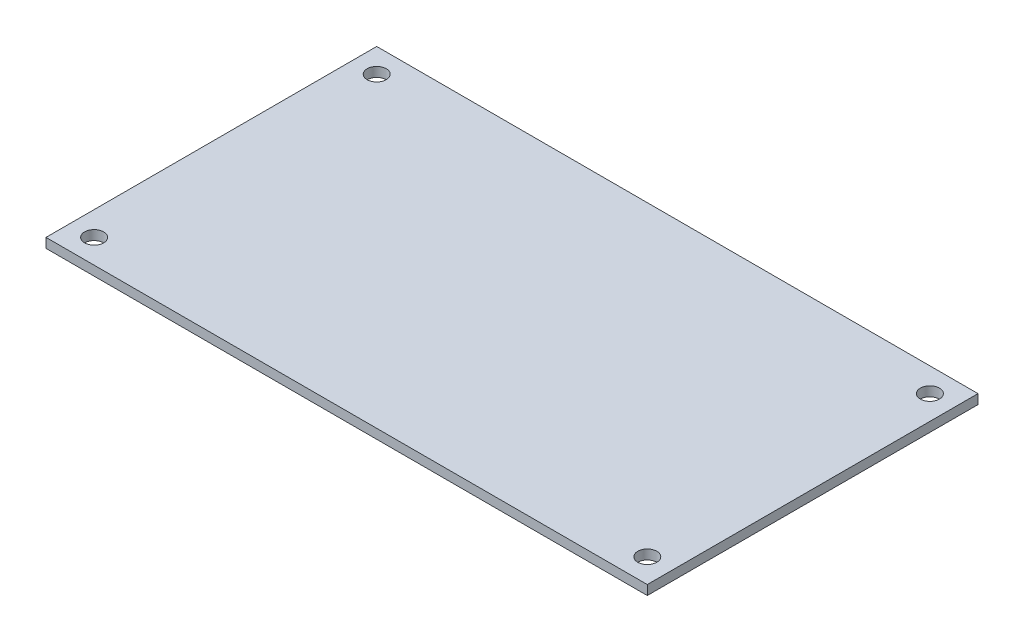
ISO-10303-21;
HEADER;
FILE_DESCRIPTION(('STEP AP214'),'2;1');
FILE_NAME('part.step','',(''),(''),'','','');
FILE_SCHEMA(('AUTOMOTIVE_DESIGN { 1 0 10303 214 1 1 1 1 }'));
ENDSEC;
DATA;
#1=APPLICATION_CONTEXT('core data for automotive mechanical design processes');
#2=APPLICATION_PROTOCOL_DEFINITION('international standard','automotive_design',2000,#1);
#3=PRODUCT_CONTEXT('',#1,'mechanical');
#4=PRODUCT('Part','Part','',(#3));
#5=PRODUCT_RELATED_PRODUCT_CATEGORY('part','',(#4));
#6=PRODUCT_DEFINITION_FORMATION('','',#4);
#7=PRODUCT_DEFINITION_CONTEXT('part definition',#1,'design');
#8=PRODUCT_DEFINITION('design','',#6,#7);
#9=PRODUCT_DEFINITION_SHAPE('','',#8);
#10=(LENGTH_UNIT() NAMED_UNIT(*) SI_UNIT(.MILLI.,.METRE.));
#11=(NAMED_UNIT(*) PLANE_ANGLE_UNIT() SI_UNIT($,.RADIAN.));
#12=(NAMED_UNIT(*) SI_UNIT($,.STERADIAN.) SOLID_ANGLE_UNIT());
#13=UNCERTAINTY_MEASURE_WITH_UNIT(LENGTH_MEASURE(1.E-05),#10,'distance_accuracy_value','');
#14=(GEOMETRIC_REPRESENTATION_CONTEXT(3) GLOBAL_UNCERTAINTY_ASSIGNED_CONTEXT((#13)) GLOBAL_UNIT_ASSIGNED_CONTEXT((#10,
#11,#12)) REPRESENTATION_CONTEXT('',''));
#15=CARTESIAN_POINT('',(0.,0.,0.));
#16=DIRECTION('',(0.,0.,1.));
#17=DIRECTION('',(1.,0.,0.));
#18=AXIS2_PLACEMENT_3D('',#15,#16,#17);
#19=CARTESIAN_POINT('',(0.,3.175,0.));
#20=DIRECTION('',(1.,0.,0.));
#21=DIRECTION('',(0.,0.,-1.));
#22=AXIS2_PLACEMENT_3D('',#19,#20,#21);
#23=PLANE('',#22);
#24=DIRECTION('',(0.,0.,1.));
#25=VECTOR('',#24,1.);
#26=CARTESIAN_POINT('',(0.,0.,0.));
#27=LINE('',#26,#25);
#28=CARTESIAN_POINT('',(0.,0.,-110.));
#29=VERTEX_POINT('',#28);
#30=CARTESIAN_POINT('',(0.,0.,0.));
#31=VERTEX_POINT('',#30);
#32=EDGE_CURVE('E96',#29,#31,#27,.T.);
#33=ORIENTED_EDGE('',*,*,#32,.T.);
#34=DIRECTION('',(0.,-1.,0.));
#35=VECTOR('',#34,1.);
#36=CARTESIAN_POINT('',(0.,3.175,0.));
#37=LINE('',#36,#35);
#38=CARTESIAN_POINT('',(0.,3.175,0.));
#39=VERTEX_POINT('',#38);
#40=EDGE_CURVE('E11',#39,#31,#37,.T.);
#41=ORIENTED_EDGE('',*,*,#40,.F.);
#42=DIRECTION('',(0.,0.,1.));
#43=VECTOR('',#42,1.);
#44=CARTESIAN_POINT('',(0.,3.175,0.));
#45=LINE('',#44,#43);
#46=CARTESIAN_POINT('',(0.,3.175,-110.));
#47=VERTEX_POINT('',#46);
#48=EDGE_CURVE('E84',#47,#39,#45,.T.);
#49=ORIENTED_EDGE('',*,*,#48,.F.);
#50=DIRECTION('',(0.,-1.,0.));
#51=VECTOR('',#50,1.);
#52=CARTESIAN_POINT('',(0.,3.175,-110.));
#53=LINE('',#52,#51);
#54=EDGE_CURVE('E92',#47,#29,#53,.T.);
#55=ORIENTED_EDGE('',*,*,#54,.T.);
#56=EDGE_LOOP('',(#33,#41,#49,#55));
#57=FACE_BOUND('',#56,.T.);
#58=ADVANCED_FACE('F33',(#57),#23,.F.);
#59=CARTESIAN_POINT('',(0.,3.175,0.));
#60=DIRECTION('',(0.,0.,-1.));
#61=DIRECTION('',(-1.,0.,0.));
#62=AXIS2_PLACEMENT_3D('',#59,#60,#61);
#63=PLANE('',#62);
#64=DIRECTION('',(1.,0.,0.));
#65=VECTOR('',#64,1.);
#66=CARTESIAN_POINT('',(0.,0.,0.));
#67=LINE('',#66,#65);
#68=CARTESIAN_POINT('',(200.,0.,0.));
#69=VERTEX_POINT('',#68);
#70=EDGE_CURVE('E88',#31,#69,#67,.T.);
#71=ORIENTED_EDGE('',*,*,#70,.T.);
#72=DIRECTION('',(0.,-1.,0.));
#73=VECTOR('',#72,1.);
#74=CARTESIAN_POINT('',(200.,3.175,0.));
#75=LINE('',#74,#73);
#76=CARTESIAN_POINT('',(200.,3.175,0.));
#77=VERTEX_POINT('',#76);
#78=EDGE_CURVE('E41',#77,#69,#75,.T.);
#79=ORIENTED_EDGE('',*,*,#78,.F.);
#80=DIRECTION('',(1.,0.,0.));
#81=VECTOR('',#80,1.);
#82=CARTESIAN_POINT('',(0.,3.175,0.));
#83=LINE('',#82,#81);
#84=EDGE_CURVE('E79',#39,#77,#83,.T.);
#85=ORIENTED_EDGE('',*,*,#84,.F.);
#86=ORIENTED_EDGE('',*,*,#40,.T.);
#87=EDGE_LOOP('',(#71,#79,#85,#86));
#88=FACE_BOUND('',#87,.T.);
#89=ADVANCED_FACE('F87',(#88),#63,.F.);
#90=CARTESIAN_POINT('',(200.,3.175,0.));
#91=DIRECTION('',(-1.,0.,0.));
#92=DIRECTION('',(0.,0.,1.));
#93=AXIS2_PLACEMENT_3D('',#90,#91,#92);
#94=PLANE('',#93);
#95=DIRECTION('',(0.,0.,-1.));
#96=VECTOR('',#95,1.);
#97=CARTESIAN_POINT('',(200.,0.,0.));
#98=LINE('',#97,#96);
#99=CARTESIAN_POINT('',(200.,0.,-110.));
#100=VERTEX_POINT('',#99);
#101=EDGE_CURVE('E66',#69,#100,#98,.T.);
#102=ORIENTED_EDGE('',*,*,#101,.T.);
#103=DIRECTION('',(0.,-1.,0.));
#104=VECTOR('',#103,1.);
#105=CARTESIAN_POINT('',(200.,3.175,-110.));
#106=LINE('',#105,#104);
#107=CARTESIAN_POINT('',(200.,3.175,-110.));
#108=VERTEX_POINT('',#107);
#109=EDGE_CURVE('E89',#108,#100,#106,.T.);
#110=ORIENTED_EDGE('',*,*,#109,.F.);
#111=DIRECTION('',(0.,0.,-1.));
#112=VECTOR('',#111,1.);
#113=CARTESIAN_POINT('',(200.,3.175,0.));
#114=LINE('',#113,#112);
#115=EDGE_CURVE('E82',#77,#108,#114,.T.);
#116=ORIENTED_EDGE('',*,*,#115,.F.);
#117=ORIENTED_EDGE('',*,*,#78,.T.);
#118=EDGE_LOOP('',(#102,#110,#116,#117));
#119=FACE_BOUND('',#118,.T.);
#120=ADVANCED_FACE('F90',(#119),#94,.F.);
#121=CARTESIAN_POINT('',(0.,3.175,-110.));
#122=DIRECTION('',(0.,0.,1.));
#123=DIRECTION('',(1.,0.,0.));
#124=AXIS2_PLACEMENT_3D('',#121,#122,#123);
#125=PLANE('',#124);
#126=DIRECTION('',(-1.,0.,0.));
#127=VECTOR('',#126,1.);
#128=CARTESIAN_POINT('',(0.,0.,-110.));
#129=LINE('',#128,#127);
#130=EDGE_CURVE('E72',#100,#29,#129,.T.);
#131=ORIENTED_EDGE('',*,*,#130,.T.);
#132=ORIENTED_EDGE('',*,*,#54,.F.);
#133=DIRECTION('',(-1.,0.,0.));
#134=VECTOR('',#133,1.);
#135=CARTESIAN_POINT('',(0.,3.175,-110.));
#136=LINE('',#135,#134);
#137=EDGE_CURVE('E49',#108,#47,#136,.T.);
#138=ORIENTED_EDGE('',*,*,#137,.F.);
#139=ORIENTED_EDGE('',*,*,#109,.T.);
#140=EDGE_LOOP('',(#131,#132,#138,#139));
#141=FACE_BOUND('',#140,.T.);
#142=ADVANCED_FACE('F104',(#141),#125,.F.);
#143=CARTESIAN_POINT('',(0.,3.175,0.));
#144=DIRECTION('',(0.,-1.,0.));
#145=DIRECTION('',(0.,0.,-1.));
#146=AXIS2_PLACEMENT_3D('',#143,#144,#145);
#147=PLANE('',#146);
#148=CARTESIAN_POINT('',(8.,3.175,-7.99999999999999));
#149=DIRECTION('',(0.,1.,0.));
#150=DIRECTION('',(0.,0.,-1.));
#151=AXIS2_PLACEMENT_3D('',#148,#149,#150);
#152=CIRCLE('',#151,3.175);
#153=CARTESIAN_POINT('',(8.,3.175,-11.175));
#154=VERTEX_POINT('',#153);
#155=EDGE_CURVE('E119',#154,#154,#152,.T.);
#156=ORIENTED_EDGE('',*,*,#155,.F.);
#157=EDGE_LOOP('',(#156));
#158=FACE_BOUND('',#157,.T.);
#159=CARTESIAN_POINT('',(192.,3.175,-7.99999999999999));
#160=DIRECTION('',(0.,1.,0.));
#161=DIRECTION('',(0.,0.,1.));
#162=AXIS2_PLACEMENT_3D('',#159,#160,#161);
#163=CIRCLE('',#162,3.175);
#164=CARTESIAN_POINT('',(192.,3.175,-4.825));
#165=VERTEX_POINT('',#164);
#166=EDGE_CURVE('E125',#165,#165,#163,.T.);
#167=ORIENTED_EDGE('',*,*,#166,.F.);
#168=EDGE_LOOP('',(#167));
#169=FACE_BOUND('',#168,.T.);
#170=CARTESIAN_POINT('',(192.,3.175,-102.));
#171=DIRECTION('',(0.,1.,0.));
#172=DIRECTION('',(0.,0.,-1.));
#173=AXIS2_PLACEMENT_3D('',#170,#171,#172);
#174=CIRCLE('',#173,3.175);
#175=CARTESIAN_POINT('',(192.,3.175,-105.175));
#176=VERTEX_POINT('',#175);
#177=EDGE_CURVE('E113',#176,#176,#174,.T.);
#178=ORIENTED_EDGE('',*,*,#177,.F.);
#179=EDGE_LOOP('',(#178));
#180=FACE_BOUND('',#179,.T.);
#181=CARTESIAN_POINT('',(8.,3.175,-102.));
#182=DIRECTION('',(0.,1.,0.));
#183=DIRECTION('',(0.,0.,1.));
#184=AXIS2_PLACEMENT_3D('',#181,#182,#183);
#185=CIRCLE('',#184,3.175);
#186=CARTESIAN_POINT('',(8.,3.175,-98.825));
#187=VERTEX_POINT('',#186);
#188=EDGE_CURVE('E99',#187,#187,#185,.T.);
#189=ORIENTED_EDGE('',*,*,#188,.F.);
#190=EDGE_LOOP('',(#189));
#191=FACE_BOUND('',#190,.T.);
#192=ORIENTED_EDGE('',*,*,#48,.T.);
#193=ORIENTED_EDGE('',*,*,#84,.T.);
#194=ORIENTED_EDGE('',*,*,#115,.T.);
#195=ORIENTED_EDGE('',*,*,#137,.T.);
#196=EDGE_LOOP('',(#192,#193,#194,#195));
#197=FACE_BOUND('',#196,.T.);
#198=ADVANCED_FACE('F80',(#158,#169,#180,#191,#197),#147,.F.);
#199=CARTESIAN_POINT('',(0.,0.,0.));
#200=DIRECTION('',(0.,-1.,0.));
#201=DIRECTION('',(0.,0.,-1.));
#202=AXIS2_PLACEMENT_3D('',#199,#200,#201);
#203=PLANE('',#202);
#204=CARTESIAN_POINT('',(8.,0.,-7.99999999999999));
#205=DIRECTION('',(0.,-1.,0.));
#206=DIRECTION('',(0.,0.,-1.));
#207=AXIS2_PLACEMENT_3D('',#204,#205,#206);
#208=CIRCLE('',#207,3.175);
#209=CARTESIAN_POINT('',(8.,0.,-11.175));
#210=VERTEX_POINT('',#209);
#211=EDGE_CURVE('E116',#210,#210,#208,.F.);
#212=ORIENTED_EDGE('',*,*,#211,.T.);
#213=EDGE_LOOP('',(#212));
#214=FACE_BOUND('',#213,.T.);
#215=CARTESIAN_POINT('',(192.,0.,-7.99999999999999));
#216=DIRECTION('',(0.,-1.,0.));
#217=DIRECTION('',(0.,0.,-1.));
#218=AXIS2_PLACEMENT_3D('',#215,#216,#217);
#219=CIRCLE('',#218,3.175);
#220=CARTESIAN_POINT('',(192.,0.,-11.175));
#221=VERTEX_POINT('',#220);
#222=EDGE_CURVE('E122',#221,#221,#219,.F.);
#223=ORIENTED_EDGE('',*,*,#222,.T.);
#224=EDGE_LOOP('',(#223));
#225=FACE_BOUND('',#224,.T.);
#226=CARTESIAN_POINT('',(192.,0.,-102.));
#227=DIRECTION('',(0.,-1.,0.));
#228=DIRECTION('',(0.,0.,-1.));
#229=AXIS2_PLACEMENT_3D('',#226,#227,#228);
#230=CIRCLE('',#229,3.175);
#231=CARTESIAN_POINT('',(192.,0.,-105.175));
#232=VERTEX_POINT('',#231);
#233=EDGE_CURVE('E128',#232,#232,#230,.F.);
#234=ORIENTED_EDGE('',*,*,#233,.T.);
#235=EDGE_LOOP('',(#234));
#236=FACE_BOUND('',#235,.T.);
#237=CARTESIAN_POINT('',(8.,0.,-102.));
#238=DIRECTION('',(0.,-1.,0.));
#239=DIRECTION('',(0.,0.,-1.));
#240=AXIS2_PLACEMENT_3D('',#237,#238,#239);
#241=CIRCLE('',#240,3.175);
#242=CARTESIAN_POINT('',(8.,0.,-105.175));
#243=VERTEX_POINT('',#242);
#244=EDGE_CURVE('E110',#243,#243,#241,.F.);
#245=ORIENTED_EDGE('',*,*,#244,.T.);
#246=EDGE_LOOP('',(#245));
#247=FACE_BOUND('',#246,.T.);
#248=ORIENTED_EDGE('',*,*,#32,.F.);
#249=ORIENTED_EDGE('',*,*,#130,.F.);
#250=ORIENTED_EDGE('',*,*,#101,.F.);
#251=ORIENTED_EDGE('',*,*,#70,.F.);
#252=EDGE_LOOP('',(#248,#249,#250,#251));
#253=FACE_BOUND('',#252,.T.);
#254=ADVANCED_FACE('F107',(#214,#225,#236,#247,#253),#203,.T.);
#255=CARTESIAN_POINT('',(8.,-0.00100000000000013,-102.));
#256=DIRECTION('',(0.,1.,0.));
#257=DIRECTION('',(0.,0.,1.));
#258=AXIS2_PLACEMENT_3D('',#255,#256,#257);
#259=CYLINDRICAL_SURFACE('',#258,3.175);
#260=ORIENTED_EDGE('',*,*,#244,.F.);
#261=EDGE_LOOP('',(#260));
#262=FACE_BOUND('',#261,.T.);
#263=ORIENTED_EDGE('',*,*,#188,.T.);
#264=EDGE_LOOP('',(#263));
#265=FACE_BOUND('',#264,.T.);
#266=ADVANCED_FACE('F142',(#262,#265),#259,.F.);
#267=CARTESIAN_POINT('',(192.,-0.00100000000000013,-102.));
#268=DIRECTION('',(0.,1.,0.));
#269=DIRECTION('',(0.,0.,1.));
#270=AXIS2_PLACEMENT_3D('',#267,#268,#269);
#271=CYLINDRICAL_SURFACE('',#270,3.175);
#272=ORIENTED_EDGE('',*,*,#233,.F.);
#273=EDGE_LOOP('',(#272));
#274=FACE_BOUND('',#273,.T.);
#275=ORIENTED_EDGE('',*,*,#177,.T.);
#276=EDGE_LOOP('',(#275));
#277=FACE_BOUND('',#276,.T.);
#278=ADVANCED_FACE('F134',(#274,#277),#271,.F.);
#279=CARTESIAN_POINT('',(192.,-0.00100000000000013,-7.99999999999999));
#280=DIRECTION('',(0.,1.,0.));
#281=DIRECTION('',(0.,0.,1.));
#282=AXIS2_PLACEMENT_3D('',#279,#280,#281);
#283=CYLINDRICAL_SURFACE('',#282,3.175);
#284=ORIENTED_EDGE('',*,*,#222,.F.);
#285=EDGE_LOOP('',(#284));
#286=FACE_BOUND('',#285,.T.);
#287=ORIENTED_EDGE('',*,*,#166,.T.);
#288=EDGE_LOOP('',(#287));
#289=FACE_BOUND('',#288,.T.);
#290=ADVANCED_FACE('F150',(#286,#289),#283,.F.);
#291=CARTESIAN_POINT('',(8.,-0.00100000000000013,-7.99999999999999));
#292=DIRECTION('',(0.,1.,0.));
#293=DIRECTION('',(0.,0.,1.));
#294=AXIS2_PLACEMENT_3D('',#291,#292,#293);
#295=CYLINDRICAL_SURFACE('',#294,3.175);
#296=ORIENTED_EDGE('',*,*,#211,.F.);
#297=EDGE_LOOP('',(#296));
#298=FACE_BOUND('',#297,.T.);
#299=ORIENTED_EDGE('',*,*,#155,.T.);
#300=EDGE_LOOP('',(#299));
#301=FACE_BOUND('',#300,.T.);
#302=ADVANCED_FACE('F200',(#298,#301),#295,.F.);
#303=CLOSED_SHELL('',(#58,#89,#120,#142,#198,#254,#266,#278,#290,#302));
#304=MANIFOLD_SOLID_BREP('B2',#303);
#305=ADVANCED_BREP_SHAPE_REPRESENTATION('',(#18,#304),#14);
#306=SHAPE_DEFINITION_REPRESENTATION(#9,#305);
ENDSEC;
END-ISO-10303-21;
